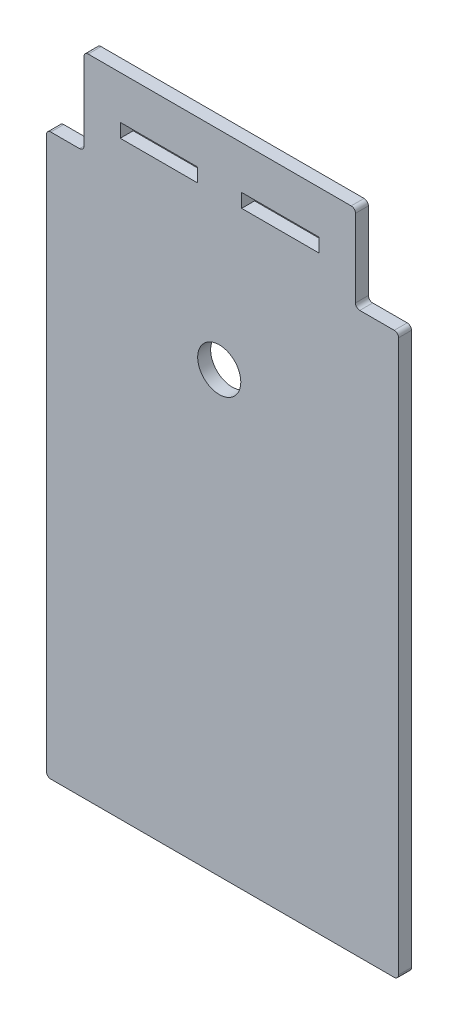
ISO-10303-21;
HEADER;
FILE_DESCRIPTION(('STEP AP214'),'2;1');
FILE_NAME('part.step','',(''),(''),'','','');
FILE_SCHEMA(('AUTOMOTIVE_DESIGN { 1 0 10303 214 1 1 1 1 }'));
ENDSEC;
DATA;
#1=APPLICATION_CONTEXT('core data for automotive mechanical design processes');
#2=APPLICATION_PROTOCOL_DEFINITION('international standard','automotive_design',2000,#1);
#3=PRODUCT_CONTEXT('',#1,'mechanical');
#4=PRODUCT('Part','Part','',(#3));
#5=PRODUCT_RELATED_PRODUCT_CATEGORY('part','',(#4));
#6=PRODUCT_DEFINITION_FORMATION('','',#4);
#7=PRODUCT_DEFINITION_CONTEXT('part definition',#1,'design');
#8=PRODUCT_DEFINITION('design','',#6,#7);
#9=PRODUCT_DEFINITION_SHAPE('','',#8);
#10=(LENGTH_UNIT() NAMED_UNIT(*) SI_UNIT(.MILLI.,.METRE.));
#11=(NAMED_UNIT(*) PLANE_ANGLE_UNIT() SI_UNIT($,.RADIAN.));
#12=(NAMED_UNIT(*) SI_UNIT($,.STERADIAN.) SOLID_ANGLE_UNIT());
#13=UNCERTAINTY_MEASURE_WITH_UNIT(LENGTH_MEASURE(1.E-05),#10,'distance_accuracy_value','');
#14=(GEOMETRIC_REPRESENTATION_CONTEXT(3) GLOBAL_UNCERTAINTY_ASSIGNED_CONTEXT((#13)) GLOBAL_UNIT_ASSIGNED_CONTEXT((#10,
#11,#12)) REPRESENTATION_CONTEXT('',''));
#15=CARTESIAN_POINT('',(0.,0.,0.));
#16=DIRECTION('',(0.,0.,1.));
#17=DIRECTION('',(1.,0.,0.));
#18=AXIS2_PLACEMENT_3D('',#15,#16,#17);
#19=CARTESIAN_POINT('',(65.1636113676577,34.,3.));
#20=DIRECTION('',(0.,0.,1.));
#21=DIRECTION('',(1.,0.,0.));
#22=AXIS2_PLACEMENT_3D('',#19,#20,#21);
#23=PLANE('',#22);
#24=CARTESIAN_POINT('',(65.1636113676577,34.,3.));
#25=DIRECTION('',(0.,0.,1.));
#26=DIRECTION('',(1.,0.,0.));
#27=AXIS2_PLACEMENT_3D('',#24,#25,#26);
#28=CIRCLE('',#27,1.);
#29=CARTESIAN_POINT('',(65.1636113676577,35.,3.));
#30=VERTEX_POINT('',#29);
#31=CARTESIAN_POINT('',(64.1636113676577,34.,3.));
#32=VERTEX_POINT('',#31);
#33=EDGE_CURVE('E267',#30,#32,#28,.T.);
#34=ORIENTED_EDGE('',*,*,#33,.T.);
#35=DIRECTION('',(0.,-1.,0.));
#36=VECTOR('',#35,1.);
#37=CARTESIAN_POINT('',(64.1636113676577,34.,3.));
#38=LINE('',#37,#36);
#39=CARTESIAN_POINT('',(64.1636113676577,-94.,3.));
#40=VERTEX_POINT('',#39);
#41=EDGE_CURVE('E270',#32,#40,#38,.T.);
#42=ORIENTED_EDGE('',*,*,#41,.T.);
#43=CARTESIAN_POINT('',(65.1636113676577,-94.,3.));
#44=DIRECTION('',(0.,0.,1.));
#45=DIRECTION('',(1.,0.,0.));
#46=AXIS2_PLACEMENT_3D('',#43,#44,#45);
#47=CIRCLE('',#46,1.);
#48=CARTESIAN_POINT('',(65.1636113676577,-95.,3.));
#49=VERTEX_POINT('',#48);
#50=EDGE_CURVE('E273',#40,#49,#47,.T.);
#51=ORIENTED_EDGE('',*,*,#50,.T.);
#52=DIRECTION('',(1.,0.,0.));
#53=VECTOR('',#52,1.);
#54=CARTESIAN_POINT('',(65.1636113676577,-95.,3.));
#55=LINE('',#54,#53);
#56=CARTESIAN_POINT('',(144.836388632342,-95.,3.));
#57=VERTEX_POINT('',#56);
#58=EDGE_CURVE('E275',#49,#57,#55,.T.);
#59=ORIENTED_EDGE('',*,*,#58,.T.);
#60=CARTESIAN_POINT('',(144.836388632342,-94.,3.));
#61=DIRECTION('',(0.,0.,1.));
#62=DIRECTION('',(1.,0.,0.));
#63=AXIS2_PLACEMENT_3D('',#60,#61,#62);
#64=CIRCLE('',#63,1.);
#65=CARTESIAN_POINT('',(145.836388632342,-94.,3.));
#66=VERTEX_POINT('',#65);
#67=EDGE_CURVE('E277',#57,#66,#64,.T.);
#68=ORIENTED_EDGE('',*,*,#67,.T.);
#69=DIRECTION('',(0.,1.,0.));
#70=VECTOR('',#69,1.);
#71=CARTESIAN_POINT('',(145.836388632342,-94.,3.));
#72=LINE('',#71,#70);
#73=CARTESIAN_POINT('',(145.836388632342,34.,3.));
#74=VERTEX_POINT('',#73);
#75=EDGE_CURVE('E279',#66,#74,#72,.T.);
#76=ORIENTED_EDGE('',*,*,#75,.T.);
#77=CARTESIAN_POINT('',(144.836388632342,34.,3.));
#78=DIRECTION('',(0.,0.,1.));
#79=DIRECTION('',(1.,0.,0.));
#80=AXIS2_PLACEMENT_3D('',#77,#78,#79);
#81=CIRCLE('',#80,1.);
#82=CARTESIAN_POINT('',(144.836388632342,35.,3.));
#83=VERTEX_POINT('',#82);
#84=EDGE_CURVE('E281',#74,#83,#81,.T.);
#85=ORIENTED_EDGE('',*,*,#84,.T.);
#86=DIRECTION('',(-1.,0.,0.));
#87=VECTOR('',#86,1.);
#88=CARTESIAN_POINT('',(144.836388632342,35.,3.));
#89=LINE('',#88,#87);
#90=CARTESIAN_POINT('',(136.836388632342,35.,3.));
#91=VERTEX_POINT('',#90);
#92=EDGE_CURVE('E283',#83,#91,#89,.T.);
#93=ORIENTED_EDGE('',*,*,#92,.T.);
#94=CARTESIAN_POINT('',(136.836388632342,36.,3.));
#95=DIRECTION('',(0.,0.,-1.));
#96=DIRECTION('',(1.,0.,0.));
#97=AXIS2_PLACEMENT_3D('',#94,#95,#96);
#98=CIRCLE('',#97,0.999999999999997);
#99=CARTESIAN_POINT('',(135.836388632342,36.,3.));
#100=VERTEX_POINT('',#99);
#101=EDGE_CURVE('E285',#91,#100,#98,.T.);
#102=ORIENTED_EDGE('',*,*,#101,.T.);
#103=DIRECTION('',(0.,1.,0.));
#104=VECTOR('',#103,1.);
#105=CARTESIAN_POINT('',(135.836388632342,36.,3.));
#106=LINE('',#105,#104);
#107=CARTESIAN_POINT('',(135.836388632342,54.,3.));
#108=VERTEX_POINT('',#107);
#109=EDGE_CURVE('E287',#100,#108,#106,.T.);
#110=ORIENTED_EDGE('',*,*,#109,.T.);
#111=CARTESIAN_POINT('',(134.836388632342,54.,3.));
#112=DIRECTION('',(0.,0.,1.));
#113=DIRECTION('',(1.,0.,0.));
#114=AXIS2_PLACEMENT_3D('',#111,#112,#113);
#115=CIRCLE('',#114,1.);
#116=CARTESIAN_POINT('',(134.836388632342,55.,3.));
#117=VERTEX_POINT('',#116);
#118=EDGE_CURVE('E289',#108,#117,#115,.T.);
#119=ORIENTED_EDGE('',*,*,#118,.T.);
#120=DIRECTION('',(-1.,0.,0.));
#121=VECTOR('',#120,1.);
#122=CARTESIAN_POINT('',(134.836388632342,55.,3.));
#123=LINE('',#122,#121);
#124=CARTESIAN_POINT('',(73.8363886323423,55.,3.));
#125=VERTEX_POINT('',#124);
#126=EDGE_CURVE('E291',#117,#125,#123,.T.);
#127=ORIENTED_EDGE('',*,*,#126,.T.);
#128=CARTESIAN_POINT('',(73.8363886323423,54.,3.));
#129=DIRECTION('',(0.,0.,1.));
#130=DIRECTION('',(1.,0.,0.));
#131=AXIS2_PLACEMENT_3D('',#128,#129,#130);
#132=CIRCLE('',#131,1.);
#133=CARTESIAN_POINT('',(72.8363886323423,54.,3.));
#134=VERTEX_POINT('',#133);
#135=EDGE_CURVE('E293',#125,#134,#132,.T.);
#136=ORIENTED_EDGE('',*,*,#135,.T.);
#137=DIRECTION('',(0.,-1.,0.));
#138=VECTOR('',#137,1.);
#139=CARTESIAN_POINT('',(72.8363886323423,54.,3.));
#140=LINE('',#139,#138);
#141=CARTESIAN_POINT('',(72.8363886323423,36.,3.));
#142=VERTEX_POINT('',#141);
#143=EDGE_CURVE('E295',#134,#142,#140,.T.);
#144=ORIENTED_EDGE('',*,*,#143,.T.);
#145=CARTESIAN_POINT('',(71.8363886323423,36.,3.));
#146=DIRECTION('',(0.,0.,-1.));
#147=DIRECTION('',(1.,0.,0.));
#148=AXIS2_PLACEMENT_3D('',#145,#146,#147);
#149=CIRCLE('',#148,0.999999999999997);
#150=CARTESIAN_POINT('',(71.8363886323423,35.,3.));
#151=VERTEX_POINT('',#150);
#152=EDGE_CURVE('E297',#142,#151,#149,.T.);
#153=ORIENTED_EDGE('',*,*,#152,.T.);
#154=DIRECTION('',(-1.,0.,0.));
#155=VECTOR('',#154,1.);
#156=CARTESIAN_POINT('',(71.8363886323423,35.,3.));
#157=LINE('',#156,#155);
#158=EDGE_CURVE('E299',#151,#30,#157,.T.);
#159=ORIENTED_EDGE('',*,*,#158,.T.);
#160=EDGE_LOOP('',(#34,#42,#51,#59,#68,#76,#85,#93,#102,#110,#119,#127,#136,#144,#153,#159));
#161=FACE_BOUND('',#160,.T.);
#162=CARTESIAN_POINT('',(104.236388632342,6.79999999999998,3.));
#163=DIRECTION('',(0.,0.,1.));
#164=DIRECTION('',(1.,0.,0.));
#165=AXIS2_PLACEMENT_3D('',#162,#163,#164);
#166=CIRCLE('',#165,5.);
#167=CARTESIAN_POINT('',(109.236388632342,6.79999999999998,3.));
#168=VERTEX_POINT('',#167);
#169=EDGE_CURVE('E261',#168,#168,#166,.T.);
#170=ORIENTED_EDGE('',*,*,#169,.F.);
#171=EDGE_LOOP('',(#170));
#172=FACE_BOUND('',#171,.T.);
#173=DIRECTION('',(-1.,0.,0.));
#174=VECTOR('',#173,1.);
#175=CARTESIAN_POINT('',(127.4,45.,3.));
#176=LINE('',#175,#174);
#177=CARTESIAN_POINT('',(127.4,45.,3.));
#178=VERTEX_POINT('',#177);
#179=CARTESIAN_POINT('',(109.436388632342,45.,3.));
#180=VERTEX_POINT('',#179);
#181=EDGE_CURVE('E232',#178,#180,#176,.T.);
#182=ORIENTED_EDGE('',*,*,#181,.F.);
#183=DIRECTION('',(0.,1.,0.));
#184=VECTOR('',#183,1.);
#185=CARTESIAN_POINT('',(127.4,41.8000000000001,3.));
#186=LINE('',#185,#184);
#187=CARTESIAN_POINT('',(127.4,41.8000000000001,3.));
#188=VERTEX_POINT('',#187);
#189=EDGE_CURVE('E230',#188,#178,#186,.T.);
#190=ORIENTED_EDGE('',*,*,#189,.F.);
#191=DIRECTION('',(1.,0.,0.));
#192=VECTOR('',#191,1.);
#193=CARTESIAN_POINT('',(109.436388632342,41.8000000000001,3.));
#194=LINE('',#193,#192);
#195=CARTESIAN_POINT('',(109.436388632342,41.8000000000001,3.));
#196=VERTEX_POINT('',#195);
#197=EDGE_CURVE('E238',#196,#188,#194,.T.);
#198=ORIENTED_EDGE('',*,*,#197,.F.);
#199=DIRECTION('',(0.,-1.,0.));
#200=VECTOR('',#199,1.);
#201=CARTESIAN_POINT('',(109.436388632342,45.,3.));
#202=LINE('',#201,#200);
#203=EDGE_CURVE('E235',#180,#196,#202,.T.);
#204=ORIENTED_EDGE('',*,*,#203,.F.);
#205=EDGE_LOOP('',(#182,#190,#198,#204));
#206=FACE_BOUND('',#205,.T.);
#207=DIRECTION('',(1.,0.,0.));
#208=VECTOR('',#207,1.);
#209=CARTESIAN_POINT('',(81.2727772646845,41.8000000000001,3.));
#210=LINE('',#209,#208);
#211=CARTESIAN_POINT('',(81.2727772646845,41.8000000000001,3.));
#212=VERTEX_POINT('',#211);
#213=CARTESIAN_POINT('',(99.2363886323423,41.8000000000001,3.));
#214=VERTEX_POINT('',#213);
#215=EDGE_CURVE('E202',#212,#214,#210,.T.);
#216=ORIENTED_EDGE('',*,*,#215,.F.);
#217=DIRECTION('',(0.,-1.,0.));
#218=VECTOR('',#217,1.);
#219=CARTESIAN_POINT('',(81.2727772646845,45.,3.));
#220=LINE('',#219,#218);
#221=CARTESIAN_POINT('',(81.2727772646845,45.,3.));
#222=VERTEX_POINT('',#221);
#223=EDGE_CURVE('E194',#222,#212,#220,.T.);
#224=ORIENTED_EDGE('',*,*,#223,.F.);
#225=DIRECTION('',(-1.,0.,0.));
#226=VECTOR('',#225,1.);
#227=CARTESIAN_POINT('',(99.2363886323423,45.,3.));
#228=LINE('',#227,#226);
#229=CARTESIAN_POINT('',(99.2363886323423,45.,3.));
#230=VERTEX_POINT('',#229);
#231=EDGE_CURVE('E216',#230,#222,#228,.T.);
#232=ORIENTED_EDGE('',*,*,#231,.F.);
#233=DIRECTION('',(0.,1.,0.));
#234=VECTOR('',#233,1.);
#235=CARTESIAN_POINT('',(99.2363886323423,41.8000000000001,3.));
#236=LINE('',#235,#234);
#237=EDGE_CURVE('E214',#214,#230,#236,.T.);
#238=ORIENTED_EDGE('',*,*,#237,.F.);
#239=EDGE_LOOP('',(#216,#224,#232,#238));
#240=FACE_BOUND('',#239,.T.);
#241=ADVANCED_FACE('F33',(#161,#172,#206,#240),#23,.T.);
#242=CARTESIAN_POINT('',(65.1636113676577,34.,0.));
#243=DIRECTION('',(0.,0.,1.));
#244=DIRECTION('',(1.,0.,0.));
#245=AXIS2_PLACEMENT_3D('',#242,#243,#244);
#246=PLANE('',#245);
#247=DIRECTION('',(0.,1.,0.));
#248=VECTOR('',#247,1.);
#249=CARTESIAN_POINT('',(127.4,41.8000000000001,0.));
#250=LINE('',#249,#248);
#251=CARTESIAN_POINT('',(127.4,41.8000000000001,0.));
#252=VERTEX_POINT('',#251);
#253=CARTESIAN_POINT('',(127.4,45.,0.));
#254=VERTEX_POINT('',#253);
#255=EDGE_CURVE('E210',#252,#254,#250,.T.);
#256=ORIENTED_EDGE('',*,*,#255,.T.);
#257=DIRECTION('',(-1.,0.,0.));
#258=VECTOR('',#257,1.);
#259=CARTESIAN_POINT('',(127.4,45.,0.));
#260=LINE('',#259,#258);
#261=CARTESIAN_POINT('',(109.436388632342,45.,0.));
#262=VERTEX_POINT('',#261);
#263=EDGE_CURVE('E243',#254,#262,#260,.T.);
#264=ORIENTED_EDGE('',*,*,#263,.T.);
#265=DIRECTION('',(0.,-1.,0.));
#266=VECTOR('',#265,1.);
#267=CARTESIAN_POINT('',(109.436388632342,45.,0.));
#268=LINE('',#267,#266);
#269=CARTESIAN_POINT('',(109.436388632342,41.8000000000001,0.));
#270=VERTEX_POINT('',#269);
#271=EDGE_CURVE('E246',#262,#270,#268,.T.);
#272=ORIENTED_EDGE('',*,*,#271,.T.);
#273=DIRECTION('',(1.,0.,0.));
#274=VECTOR('',#273,1.);
#275=CARTESIAN_POINT('',(109.436388632342,41.8000000000001,0.));
#276=LINE('',#275,#274);
#277=EDGE_CURVE('E233',#270,#252,#276,.T.);
#278=ORIENTED_EDGE('',*,*,#277,.T.);
#279=EDGE_LOOP('',(#256,#264,#272,#278));
#280=FACE_BOUND('',#279,.T.);
#281=CARTESIAN_POINT('',(65.1636113676577,34.,0.));
#282=DIRECTION('',(0.,0.,1.));
#283=DIRECTION('',(1.,0.,0.));
#284=AXIS2_PLACEMENT_3D('',#281,#282,#283);
#285=CIRCLE('',#284,1.);
#286=CARTESIAN_POINT('',(65.1636113676577,35.,0.));
#287=VERTEX_POINT('',#286);
#288=CARTESIAN_POINT('',(64.1636113676577,34.,0.));
#289=VERTEX_POINT('',#288);
#290=EDGE_CURVE('E264',#287,#289,#285,.T.);
#291=ORIENTED_EDGE('',*,*,#290,.F.);
#292=DIRECTION('',(-1.,0.,0.));
#293=VECTOR('',#292,1.);
#294=CARTESIAN_POINT('',(71.8363886323423,35.,0.));
#295=LINE('',#294,#293);
#296=CARTESIAN_POINT('',(71.8363886323423,35.,0.));
#297=VERTEX_POINT('',#296);
#298=EDGE_CURVE('E271',#297,#287,#295,.T.);
#299=ORIENTED_EDGE('',*,*,#298,.F.);
#300=CARTESIAN_POINT('',(71.8363886323423,36.,0.));
#301=DIRECTION('',(0.,0.,-1.));
#302=DIRECTION('',(1.,0.,0.));
#303=AXIS2_PLACEMENT_3D('',#300,#301,#302);
#304=CIRCLE('',#303,0.999999999999997);
#305=CARTESIAN_POINT('',(72.8363886323423,36.,0.));
#306=VERTEX_POINT('',#305);
#307=EDGE_CURVE('E330',#306,#297,#304,.T.);
#308=ORIENTED_EDGE('',*,*,#307,.F.);
#309=DIRECTION('',(0.,-1.,0.));
#310=VECTOR('',#309,1.);
#311=CARTESIAN_POINT('',(72.8363886323423,54.,0.));
#312=LINE('',#311,#310);
#313=CARTESIAN_POINT('',(72.8363886323423,54.,0.));
#314=VERTEX_POINT('',#313);
#315=EDGE_CURVE('E328',#314,#306,#312,.T.);
#316=ORIENTED_EDGE('',*,*,#315,.F.);
#317=CARTESIAN_POINT('',(73.8363886323423,54.,0.));
#318=DIRECTION('',(0.,0.,1.));
#319=DIRECTION('',(1.,0.,0.));
#320=AXIS2_PLACEMENT_3D('',#317,#318,#319);
#321=CIRCLE('',#320,1.);
#322=CARTESIAN_POINT('',(73.8363886323423,55.,0.));
#323=VERTEX_POINT('',#322);
#324=EDGE_CURVE('E326',#323,#314,#321,.T.);
#325=ORIENTED_EDGE('',*,*,#324,.F.);
#326=DIRECTION('',(-1.,0.,0.));
#327=VECTOR('',#326,1.);
#328=CARTESIAN_POINT('',(134.836388632342,55.,0.));
#329=LINE('',#328,#327);
#330=CARTESIAN_POINT('',(134.836388632342,55.,0.));
#331=VERTEX_POINT('',#330);
#332=EDGE_CURVE('E324',#331,#323,#329,.T.);
#333=ORIENTED_EDGE('',*,*,#332,.F.);
#334=CARTESIAN_POINT('',(134.836388632342,54.,0.));
#335=DIRECTION('',(0.,0.,1.));
#336=DIRECTION('',(1.,0.,0.));
#337=AXIS2_PLACEMENT_3D('',#334,#335,#336);
#338=CIRCLE('',#337,1.);
#339=CARTESIAN_POINT('',(135.836388632342,54.,0.));
#340=VERTEX_POINT('',#339);
#341=EDGE_CURVE('E322',#340,#331,#338,.T.);
#342=ORIENTED_EDGE('',*,*,#341,.F.);
#343=DIRECTION('',(0.,1.,0.));
#344=VECTOR('',#343,1.);
#345=CARTESIAN_POINT('',(135.836388632342,36.,0.));
#346=LINE('',#345,#344);
#347=CARTESIAN_POINT('',(135.836388632342,36.,0.));
#348=VERTEX_POINT('',#347);
#349=EDGE_CURVE('E320',#348,#340,#346,.T.);
#350=ORIENTED_EDGE('',*,*,#349,.F.);
#351=CARTESIAN_POINT('',(136.836388632342,36.,0.));
#352=DIRECTION('',(0.,0.,-1.));
#353=DIRECTION('',(1.,0.,0.));
#354=AXIS2_PLACEMENT_3D('',#351,#352,#353);
#355=CIRCLE('',#354,0.999999999999997);
#356=CARTESIAN_POINT('',(136.836388632342,35.,0.));
#357=VERTEX_POINT('',#356);
#358=EDGE_CURVE('E318',#357,#348,#355,.T.);
#359=ORIENTED_EDGE('',*,*,#358,.F.);
#360=DIRECTION('',(-1.,0.,0.));
#361=VECTOR('',#360,1.);
#362=CARTESIAN_POINT('',(144.836388632342,35.,0.));
#363=LINE('',#362,#361);
#364=CARTESIAN_POINT('',(144.836388632342,35.,0.));
#365=VERTEX_POINT('',#364);
#366=EDGE_CURVE('E316',#365,#357,#363,.T.);
#367=ORIENTED_EDGE('',*,*,#366,.F.);
#368=CARTESIAN_POINT('',(144.836388632342,34.,0.));
#369=DIRECTION('',(0.,0.,1.));
#370=DIRECTION('',(1.,0.,0.));
#371=AXIS2_PLACEMENT_3D('',#368,#369,#370);
#372=CIRCLE('',#371,1.);
#373=CARTESIAN_POINT('',(145.836388632342,34.,0.));
#374=VERTEX_POINT('',#373);
#375=EDGE_CURVE('E314',#374,#365,#372,.T.);
#376=ORIENTED_EDGE('',*,*,#375,.F.);
#377=DIRECTION('',(0.,1.,0.));
#378=VECTOR('',#377,1.);
#379=CARTESIAN_POINT('',(145.836388632342,-94.,0.));
#380=LINE('',#379,#378);
#381=CARTESIAN_POINT('',(145.836388632342,-94.,0.));
#382=VERTEX_POINT('',#381);
#383=EDGE_CURVE('E312',#382,#374,#380,.T.);
#384=ORIENTED_EDGE('',*,*,#383,.F.);
#385=CARTESIAN_POINT('',(144.836388632342,-94.,0.));
#386=DIRECTION('',(0.,0.,1.));
#387=DIRECTION('',(1.,0.,0.));
#388=AXIS2_PLACEMENT_3D('',#385,#386,#387);
#389=CIRCLE('',#388,1.);
#390=CARTESIAN_POINT('',(144.836388632342,-95.,0.));
#391=VERTEX_POINT('',#390);
#392=EDGE_CURVE('E310',#391,#382,#389,.T.);
#393=ORIENTED_EDGE('',*,*,#392,.F.);
#394=DIRECTION('',(1.,0.,0.));
#395=VECTOR('',#394,1.);
#396=CARTESIAN_POINT('',(65.1636113676577,-95.,0.));
#397=LINE('',#396,#395);
#398=CARTESIAN_POINT('',(65.1636113676577,-95.,0.));
#399=VERTEX_POINT('',#398);
#400=EDGE_CURVE('E308',#399,#391,#397,.T.);
#401=ORIENTED_EDGE('',*,*,#400,.F.);
#402=CARTESIAN_POINT('',(65.1636113676577,-94.,0.));
#403=DIRECTION('',(0.,0.,1.));
#404=DIRECTION('',(1.,0.,0.));
#405=AXIS2_PLACEMENT_3D('',#402,#403,#404);
#406=CIRCLE('',#405,1.);
#407=CARTESIAN_POINT('',(64.1636113676577,-94.,0.));
#408=VERTEX_POINT('',#407);
#409=EDGE_CURVE('E306',#408,#399,#406,.T.);
#410=ORIENTED_EDGE('',*,*,#409,.F.);
#411=DIRECTION('',(0.,-1.,0.));
#412=VECTOR('',#411,1.);
#413=CARTESIAN_POINT('',(64.1636113676577,-39.6153776325345,0.));
#414=LINE('',#413,#412);
#415=EDGE_CURVE('E304',#289,#408,#414,.T.);
#416=ORIENTED_EDGE('',*,*,#415,.F.);
#417=EDGE_LOOP('',(#291,#299,#308,#316,#325,#333,#342,#350,#359,#367,#376,#384,#393,#401,#410,#416));
#418=FACE_BOUND('',#417,.T.);
#419=CARTESIAN_POINT('',(104.236388632342,6.79999999999998,0.));
#420=DIRECTION('',(0.,0.,1.));
#421=DIRECTION('',(1.,0.,0.));
#422=AXIS2_PLACEMENT_3D('',#419,#420,#421);
#423=CIRCLE('',#422,5.);
#424=CARTESIAN_POINT('',(109.236388632342,6.79999999999998,0.));
#425=VERTEX_POINT('',#424);
#426=EDGE_CURVE('E260',#425,#425,#423,.T.);
#427=ORIENTED_EDGE('',*,*,#426,.T.);
#428=EDGE_LOOP('',(#427));
#429=FACE_BOUND('',#428,.T.);
#430=DIRECTION('',(0.,-1.,0.));
#431=VECTOR('',#430,1.);
#432=CARTESIAN_POINT('',(81.2727772646845,45.,0.));
#433=LINE('',#432,#431);
#434=CARTESIAN_POINT('',(81.2727772646845,45.,0.));
#435=VERTEX_POINT('',#434);
#436=CARTESIAN_POINT('',(81.2727772646845,41.8000000000001,0.));
#437=VERTEX_POINT('',#436);
#438=EDGE_CURVE('E56',#435,#437,#433,.T.);
#439=ORIENTED_EDGE('',*,*,#438,.T.);
#440=DIRECTION('',(1.,0.,0.));
#441=VECTOR('',#440,1.);
#442=CARTESIAN_POINT('',(81.2727772646845,41.8000000000001,0.));
#443=LINE('',#442,#441);
#444=CARTESIAN_POINT('',(99.2363886323423,41.8000000000001,0.));
#445=VERTEX_POINT('',#444);
#446=EDGE_CURVE('E209',#437,#445,#443,.T.);
#447=ORIENTED_EDGE('',*,*,#446,.T.);
#448=DIRECTION('',(0.,1.,0.));
#449=VECTOR('',#448,1.);
#450=CARTESIAN_POINT('',(99.2363886323423,41.8000000000001,0.));
#451=LINE('',#450,#449);
#452=CARTESIAN_POINT('',(99.2363886323423,45.,0.));
#453=VERTEX_POINT('',#452);
#454=EDGE_CURVE('E222',#445,#453,#451,.T.);
#455=ORIENTED_EDGE('',*,*,#454,.T.);
#456=DIRECTION('',(-1.,0.,0.));
#457=VECTOR('',#456,1.);
#458=CARTESIAN_POINT('',(99.2363886323423,45.,0.));
#459=LINE('',#458,#457);
#460=EDGE_CURVE('E203',#453,#435,#459,.T.);
#461=ORIENTED_EDGE('',*,*,#460,.T.);
#462=EDGE_LOOP('',(#439,#447,#455,#461));
#463=FACE_BOUND('',#462,.T.);
#464=ADVANCED_FACE('F384',(#280,#418,#429,#463),#246,.F.);
#465=CARTESIAN_POINT('',(65.1636113676577,34.,3.));
#466=DIRECTION('',(0.,0.,-1.));
#467=DIRECTION('',(-1.,0.,0.));
#468=AXIS2_PLACEMENT_3D('',#465,#466,#467);
#469=CYLINDRICAL_SURFACE('',#468,1.);
#470=ORIENTED_EDGE('',*,*,#290,.T.);
#471=DIRECTION('',(0.,0.,-1.));
#472=VECTOR('',#471,1.);
#473=CARTESIAN_POINT('',(64.1636113676577,34.,3.));
#474=LINE('',#473,#472);
#475=EDGE_CURVE('E11',#32,#289,#474,.T.);
#476=ORIENTED_EDGE('',*,*,#475,.F.);
#477=ORIENTED_EDGE('',*,*,#33,.F.);
#478=DIRECTION('',(0.,0.,-1.));
#479=VECTOR('',#478,1.);
#480=CARTESIAN_POINT('',(65.1636113676577,35.,3.));
#481=LINE('',#480,#479);
#482=EDGE_CURVE('E301',#30,#287,#481,.T.);
#483=ORIENTED_EDGE('',*,*,#482,.T.);
#484=EDGE_LOOP('',(#470,#476,#477,#483));
#485=FACE_BOUND('',#484,.T.);
#486=ADVANCED_FACE('F35',(#485),#469,.T.);
#487=CARTESIAN_POINT('',(64.1636113676577,-39.6153776325345,3.));
#488=DIRECTION('',(1.,0.,0.));
#489=DIRECTION('',(0.,0.,-1.));
#490=AXIS2_PLACEMENT_3D('',#487,#488,#489);
#491=PLANE('',#490);
#492=ORIENTED_EDGE('',*,*,#415,.T.);
#493=DIRECTION('',(0.,0.,-1.));
#494=VECTOR('',#493,1.);
#495=CARTESIAN_POINT('',(64.1636113676577,-94.,3.));
#496=LINE('',#495,#494);
#497=EDGE_CURVE('E41',#40,#408,#496,.T.);
#498=ORIENTED_EDGE('',*,*,#497,.F.);
#499=ORIENTED_EDGE('',*,*,#41,.F.);
#500=ORIENTED_EDGE('',*,*,#475,.T.);
#501=EDGE_LOOP('',(#492,#498,#499,#500));
#502=FACE_BOUND('',#501,.T.);
#503=ADVANCED_FACE('F402',(#502),#491,.F.);
#504=CARTESIAN_POINT('',(65.1636113676577,-94.,3.));
#505=DIRECTION('',(0.,0.,-1.));
#506=DIRECTION('',(-1.,0.,0.));
#507=AXIS2_PLACEMENT_3D('',#504,#505,#506);
#508=CYLINDRICAL_SURFACE('',#507,1.);
#509=ORIENTED_EDGE('',*,*,#409,.T.);
#510=DIRECTION('',(0.,0.,-1.));
#511=VECTOR('',#510,1.);
#512=CARTESIAN_POINT('',(65.1636113676577,-95.,3.));
#513=LINE('',#512,#511);
#514=EDGE_CURVE('E371',#49,#399,#513,.T.);
#515=ORIENTED_EDGE('',*,*,#514,.F.);
#516=ORIENTED_EDGE('',*,*,#50,.F.);
#517=ORIENTED_EDGE('',*,*,#497,.T.);
#518=EDGE_LOOP('',(#509,#515,#516,#517));
#519=FACE_BOUND('',#518,.T.);
#520=ADVANCED_FACE('F378',(#519),#508,.T.);
#521=CARTESIAN_POINT('',(65.1636113676577,-95.,3.));
#522=DIRECTION('',(0.,1.,0.));
#523=DIRECTION('',(0.,0.,1.));
#524=AXIS2_PLACEMENT_3D('',#521,#522,#523);
#525=PLANE('',#524);
#526=ORIENTED_EDGE('',*,*,#400,.T.);
#527=DIRECTION('',(0.,0.,-1.));
#528=VECTOR('',#527,1.);
#529=CARTESIAN_POINT('',(144.836388632342,-95.,3.));
#530=LINE('',#529,#528);
#531=EDGE_CURVE('E368',#57,#391,#530,.T.);
#532=ORIENTED_EDGE('',*,*,#531,.F.);
#533=ORIENTED_EDGE('',*,*,#58,.F.);
#534=ORIENTED_EDGE('',*,*,#514,.T.);
#535=EDGE_LOOP('',(#526,#532,#533,#534));
#536=FACE_BOUND('',#535,.T.);
#537=ADVANCED_FACE('F390',(#536),#525,.F.);
#538=CARTESIAN_POINT('',(144.836388632342,-94.,3.));
#539=DIRECTION('',(0.,0.,-1.));
#540=DIRECTION('',(-1.,0.,0.));
#541=AXIS2_PLACEMENT_3D('',#538,#539,#540);
#542=CYLINDRICAL_SURFACE('',#541,1.);
#543=ORIENTED_EDGE('',*,*,#392,.T.);
#544=DIRECTION('',(0.,0.,-1.));
#545=VECTOR('',#544,1.);
#546=CARTESIAN_POINT('',(145.836388632342,-94.,3.));
#547=LINE('',#546,#545);
#548=EDGE_CURVE('E365',#66,#382,#547,.T.);
#549=ORIENTED_EDGE('',*,*,#548,.F.);
#550=ORIENTED_EDGE('',*,*,#67,.F.);
#551=ORIENTED_EDGE('',*,*,#531,.T.);
#552=EDGE_LOOP('',(#543,#549,#550,#551));
#553=FACE_BOUND('',#552,.T.);
#554=ADVANCED_FACE('F394',(#553),#542,.T.);
#555=CARTESIAN_POINT('',(145.836388632342,-94.,3.));
#556=DIRECTION('',(-1.,0.,0.));
#557=DIRECTION('',(0.,0.,1.));
#558=AXIS2_PLACEMENT_3D('',#555,#556,#557);
#559=PLANE('',#558);
#560=ORIENTED_EDGE('',*,*,#383,.T.);
#561=DIRECTION('',(0.,0.,-1.));
#562=VECTOR('',#561,1.);
#563=CARTESIAN_POINT('',(145.836388632342,34.,3.));
#564=LINE('',#563,#562);
#565=EDGE_CURVE('E362',#74,#374,#564,.T.);
#566=ORIENTED_EDGE('',*,*,#565,.F.);
#567=ORIENTED_EDGE('',*,*,#75,.F.);
#568=ORIENTED_EDGE('',*,*,#548,.T.);
#569=EDGE_LOOP('',(#560,#566,#567,#568));
#570=FACE_BOUND('',#569,.T.);
#571=ADVANCED_FACE('F455',(#570),#559,.F.);
#572=CARTESIAN_POINT('',(144.836388632342,34.,3.));
#573=DIRECTION('',(0.,0.,-1.));
#574=DIRECTION('',(-1.,0.,0.));
#575=AXIS2_PLACEMENT_3D('',#572,#573,#574);
#576=CYLINDRICAL_SURFACE('',#575,1.);
#577=ORIENTED_EDGE('',*,*,#375,.T.);
#578=DIRECTION('',(0.,0.,-1.));
#579=VECTOR('',#578,1.);
#580=CARTESIAN_POINT('',(144.836388632342,35.,3.));
#581=LINE('',#580,#579);
#582=EDGE_CURVE('E359',#83,#365,#581,.T.);
#583=ORIENTED_EDGE('',*,*,#582,.F.);
#584=ORIENTED_EDGE('',*,*,#84,.F.);
#585=ORIENTED_EDGE('',*,*,#565,.T.);
#586=EDGE_LOOP('',(#577,#583,#584,#585));
#587=FACE_BOUND('',#586,.T.);
#588=ADVANCED_FACE('F452',(#587),#576,.T.);
#589=CARTESIAN_POINT('',(144.836388632342,35.,3.));
#590=DIRECTION('',(0.,-1.,0.));
#591=DIRECTION('',(0.,0.,-1.));
#592=AXIS2_PLACEMENT_3D('',#589,#590,#591);
#593=PLANE('',#592);
#594=ORIENTED_EDGE('',*,*,#366,.T.);
#595=DIRECTION('',(0.,0.,-1.));
#596=VECTOR('',#595,1.);
#597=CARTESIAN_POINT('',(136.836388632342,35.,3.));
#598=LINE('',#597,#596);
#599=EDGE_CURVE('E356',#91,#357,#598,.T.);
#600=ORIENTED_EDGE('',*,*,#599,.F.);
#601=ORIENTED_EDGE('',*,*,#92,.F.);
#602=ORIENTED_EDGE('',*,*,#582,.T.);
#603=EDGE_LOOP('',(#594,#600,#601,#602));
#604=FACE_BOUND('',#603,.T.);
#605=ADVANCED_FACE('F448',(#604),#593,.F.);
#606=CARTESIAN_POINT('',(136.836388632342,36.,3.));
#607=DIRECTION('',(0.,0.,-1.));
#608=DIRECTION('',(-1.,0.,0.));
#609=AXIS2_PLACEMENT_3D('',#606,#607,#608);
#610=CYLINDRICAL_SURFACE('',#609,0.999999999999997);
#611=ORIENTED_EDGE('',*,*,#358,.T.);
#612=DIRECTION('',(0.,0.,-1.));
#613=VECTOR('',#612,1.);
#614=CARTESIAN_POINT('',(135.836388632342,36.,3.));
#615=LINE('',#614,#613);
#616=EDGE_CURVE('E353',#100,#348,#615,.T.);
#617=ORIENTED_EDGE('',*,*,#616,.F.);
#618=ORIENTED_EDGE('',*,*,#101,.F.);
#619=ORIENTED_EDGE('',*,*,#599,.T.);
#620=EDGE_LOOP('',(#611,#617,#618,#619));
#621=FACE_BOUND('',#620,.T.);
#622=ADVANCED_FACE('F444',(#621),#610,.F.);
#623=CARTESIAN_POINT('',(135.836388632342,36.,3.));
#624=DIRECTION('',(-1.,0.,0.));
#625=DIRECTION('',(0.,0.,1.));
#626=AXIS2_PLACEMENT_3D('',#623,#624,#625);
#627=PLANE('',#626);
#628=ORIENTED_EDGE('',*,*,#349,.T.);
#629=DIRECTION('',(0.,0.,-1.));
#630=VECTOR('',#629,1.);
#631=CARTESIAN_POINT('',(135.836388632342,54.,3.));
#632=LINE('',#631,#630);
#633=EDGE_CURVE('E350',#108,#340,#632,.T.);
#634=ORIENTED_EDGE('',*,*,#633,.F.);
#635=ORIENTED_EDGE('',*,*,#109,.F.);
#636=ORIENTED_EDGE('',*,*,#616,.T.);
#637=EDGE_LOOP('',(#628,#634,#635,#636));
#638=FACE_BOUND('',#637,.T.);
#639=ADVANCED_FACE('F439',(#638),#627,.F.);
#640=CARTESIAN_POINT('',(134.836388632342,54.,3.));
#641=DIRECTION('',(0.,0.,-1.));
#642=DIRECTION('',(-1.,0.,0.));
#643=AXIS2_PLACEMENT_3D('',#640,#641,#642);
#644=CYLINDRICAL_SURFACE('',#643,1.);
#645=ORIENTED_EDGE('',*,*,#341,.T.);
#646=DIRECTION('',(0.,0.,-1.));
#647=VECTOR('',#646,1.);
#648=CARTESIAN_POINT('',(134.836388632342,55.,3.));
#649=LINE('',#648,#647);
#650=EDGE_CURVE('E347',#117,#331,#649,.T.);
#651=ORIENTED_EDGE('',*,*,#650,.F.);
#652=ORIENTED_EDGE('',*,*,#118,.F.);
#653=ORIENTED_EDGE('',*,*,#633,.T.);
#654=EDGE_LOOP('',(#645,#651,#652,#653));
#655=FACE_BOUND('',#654,.T.);
#656=ADVANCED_FACE('F433',(#655),#644,.T.);
#657=CARTESIAN_POINT('',(134.836388632342,55.,3.));
#658=DIRECTION('',(0.,-1.,0.));
#659=DIRECTION('',(0.,0.,-1.));
#660=AXIS2_PLACEMENT_3D('',#657,#658,#659);
#661=PLANE('',#660);
#662=ORIENTED_EDGE('',*,*,#332,.T.);
#663=DIRECTION('',(0.,0.,-1.));
#664=VECTOR('',#663,1.);
#665=CARTESIAN_POINT('',(73.8363886323423,55.,3.));
#666=LINE('',#665,#664);
#667=EDGE_CURVE('E344',#125,#323,#666,.T.);
#668=ORIENTED_EDGE('',*,*,#667,.F.);
#669=ORIENTED_EDGE('',*,*,#126,.F.);
#670=ORIENTED_EDGE('',*,*,#650,.T.);
#671=EDGE_LOOP('',(#662,#668,#669,#670));
#672=FACE_BOUND('',#671,.T.);
#673=ADVANCED_FACE('F429',(#672),#661,.F.);
#674=CARTESIAN_POINT('',(73.8363886323423,54.,3.));
#675=DIRECTION('',(0.,0.,-1.));
#676=DIRECTION('',(-1.,0.,0.));
#677=AXIS2_PLACEMENT_3D('',#674,#675,#676);
#678=CYLINDRICAL_SURFACE('',#677,1.);
#679=ORIENTED_EDGE('',*,*,#324,.T.);
#680=DIRECTION('',(0.,0.,-1.));
#681=VECTOR('',#680,1.);
#682=CARTESIAN_POINT('',(72.8363886323423,54.,3.));
#683=LINE('',#682,#681);
#684=EDGE_CURVE('E341',#134,#314,#683,.T.);
#685=ORIENTED_EDGE('',*,*,#684,.F.);
#686=ORIENTED_EDGE('',*,*,#135,.F.);
#687=ORIENTED_EDGE('',*,*,#667,.T.);
#688=EDGE_LOOP('',(#679,#685,#686,#687));
#689=FACE_BOUND('',#688,.T.);
#690=ADVANCED_FACE('F424',(#689),#678,.T.);
#691=CARTESIAN_POINT('',(72.8363886323423,54.,3.));
#692=DIRECTION('',(1.,0.,0.));
#693=DIRECTION('',(0.,0.,-1.));
#694=AXIS2_PLACEMENT_3D('',#691,#692,#693);
#695=PLANE('',#694);
#696=ORIENTED_EDGE('',*,*,#315,.T.);
#697=DIRECTION('',(0.,0.,-1.));
#698=VECTOR('',#697,1.);
#699=CARTESIAN_POINT('',(72.8363886323423,36.,3.));
#700=LINE('',#699,#698);
#701=EDGE_CURVE('E338',#142,#306,#700,.T.);
#702=ORIENTED_EDGE('',*,*,#701,.F.);
#703=ORIENTED_EDGE('',*,*,#143,.F.);
#704=ORIENTED_EDGE('',*,*,#684,.T.);
#705=EDGE_LOOP('',(#696,#702,#703,#704));
#706=FACE_BOUND('',#705,.T.);
#707=ADVANCED_FACE('F418',(#706),#695,.F.);
#708=CARTESIAN_POINT('',(71.8363886323423,36.,3.));
#709=DIRECTION('',(0.,0.,-1.));
#710=DIRECTION('',(-1.,0.,0.));
#711=AXIS2_PLACEMENT_3D('',#708,#709,#710);
#712=CYLINDRICAL_SURFACE('',#711,0.999999999999997);
#713=ORIENTED_EDGE('',*,*,#307,.T.);
#714=DIRECTION('',(0.,0.,-1.));
#715=VECTOR('',#714,1.);
#716=CARTESIAN_POINT('',(71.8363886323423,35.,3.));
#717=LINE('',#716,#715);
#718=EDGE_CURVE('E335',#151,#297,#717,.T.);
#719=ORIENTED_EDGE('',*,*,#718,.F.);
#720=ORIENTED_EDGE('',*,*,#152,.F.);
#721=ORIENTED_EDGE('',*,*,#701,.T.);
#722=EDGE_LOOP('',(#713,#719,#720,#721));
#723=FACE_BOUND('',#722,.T.);
#724=ADVANCED_FACE('F414',(#723),#712,.F.);
#725=CARTESIAN_POINT('',(71.8363886323423,35.,3.));
#726=DIRECTION('',(0.,-1.,0.));
#727=DIRECTION('',(0.,0.,-1.));
#728=AXIS2_PLACEMENT_3D('',#725,#726,#727);
#729=PLANE('',#728);
#730=ORIENTED_EDGE('',*,*,#298,.T.);
#731=ORIENTED_EDGE('',*,*,#482,.F.);
#732=ORIENTED_EDGE('',*,*,#158,.F.);
#733=ORIENTED_EDGE('',*,*,#718,.T.);
#734=EDGE_LOOP('',(#730,#731,#732,#733));
#735=FACE_BOUND('',#734,.T.);
#736=ADVANCED_FACE('F409',(#735),#729,.F.);
#737=CARTESIAN_POINT('',(104.236388632342,6.79999999999998,3.));
#738=DIRECTION('',(0.,0.,-1.));
#739=DIRECTION('',(-1.,0.,0.));
#740=AXIS2_PLACEMENT_3D('',#737,#738,#739);
#741=CYLINDRICAL_SURFACE('',#740,5.);
#742=ORIENTED_EDGE('',*,*,#169,.T.);
#743=EDGE_LOOP('',(#742));
#744=FACE_BOUND('',#743,.T.);
#745=ORIENTED_EDGE('',*,*,#426,.F.);
#746=EDGE_LOOP('',(#745));
#747=FACE_BOUND('',#746,.T.);
#748=ADVANCED_FACE('F472',(#744,#747),#741,.F.);
#749=CARTESIAN_POINT('',(127.4,41.8000000000001,3.));
#750=DIRECTION('',(-1.,0.,0.));
#751=DIRECTION('',(0.,0.,1.));
#752=AXIS2_PLACEMENT_3D('',#749,#750,#751);
#753=PLANE('',#752);
#754=ORIENTED_EDGE('',*,*,#255,.F.);
#755=DIRECTION('',(0.,0.,-1.));
#756=VECTOR('',#755,1.);
#757=CARTESIAN_POINT('',(127.4,41.8000000000001,3.));
#758=LINE('',#757,#756);
#759=EDGE_CURVE('E240',#188,#252,#758,.T.);
#760=ORIENTED_EDGE('',*,*,#759,.F.);
#761=ORIENTED_EDGE('',*,*,#189,.T.);
#762=DIRECTION('',(0.,0.,-1.));
#763=VECTOR('',#762,1.);
#764=CARTESIAN_POINT('',(127.4,45.,3.));
#765=LINE('',#764,#763);
#766=EDGE_CURVE('E257',#178,#254,#765,.T.);
#767=ORIENTED_EDGE('',*,*,#766,.T.);
#768=EDGE_LOOP('',(#754,#760,#761,#767));
#769=FACE_BOUND('',#768,.T.);
#770=ADVANCED_FACE('F534',(#769),#753,.T.);
#771=CARTESIAN_POINT('',(127.4,45.,3.));
#772=DIRECTION('',(0.,-1.,0.));
#773=DIRECTION('',(0.,0.,-1.));
#774=AXIS2_PLACEMENT_3D('',#771,#772,#773);
#775=PLANE('',#774);
#776=ORIENTED_EDGE('',*,*,#263,.F.);
#777=ORIENTED_EDGE('',*,*,#766,.F.);
#778=ORIENTED_EDGE('',*,*,#181,.T.);
#779=DIRECTION('',(0.,0.,-1.));
#780=VECTOR('',#779,1.);
#781=CARTESIAN_POINT('',(109.436388632342,45.,3.));
#782=LINE('',#781,#780);
#783=EDGE_CURVE('E255',#180,#262,#782,.T.);
#784=ORIENTED_EDGE('',*,*,#783,.T.);
#785=EDGE_LOOP('',(#776,#777,#778,#784));
#786=FACE_BOUND('',#785,.T.);
#787=ADVANCED_FACE('F541',(#786),#775,.T.);
#788=CARTESIAN_POINT('',(109.436388632342,45.,3.));
#789=DIRECTION('',(1.,0.,0.));
#790=DIRECTION('',(0.,0.,-1.));
#791=AXIS2_PLACEMENT_3D('',#788,#789,#790);
#792=PLANE('',#791);
#793=ORIENTED_EDGE('',*,*,#271,.F.);
#794=ORIENTED_EDGE('',*,*,#783,.F.);
#795=ORIENTED_EDGE('',*,*,#203,.T.);
#796=DIRECTION('',(0.,0.,-1.));
#797=VECTOR('',#796,1.);
#798=CARTESIAN_POINT('',(109.436388632342,41.8000000000001,3.));
#799=LINE('',#798,#797);
#800=EDGE_CURVE('E253',#196,#270,#799,.T.);
#801=ORIENTED_EDGE('',*,*,#800,.T.);
#802=EDGE_LOOP('',(#793,#794,#795,#801));
#803=FACE_BOUND('',#802,.T.);
#804=ADVANCED_FACE('F548',(#803),#792,.T.);
#805=CARTESIAN_POINT('',(109.436388632342,41.8000000000001,3.));
#806=DIRECTION('',(0.,1.,0.));
#807=DIRECTION('',(0.,0.,1.));
#808=AXIS2_PLACEMENT_3D('',#805,#806,#807);
#809=PLANE('',#808);
#810=ORIENTED_EDGE('',*,*,#277,.F.);
#811=ORIENTED_EDGE('',*,*,#800,.F.);
#812=ORIENTED_EDGE('',*,*,#197,.T.);
#813=ORIENTED_EDGE('',*,*,#759,.T.);
#814=EDGE_LOOP('',(#810,#811,#812,#813));
#815=FACE_BOUND('',#814,.T.);
#816=ADVANCED_FACE('F556',(#815),#809,.T.);
#817=CARTESIAN_POINT('',(81.2727772646845,45.,3.));
#818=DIRECTION('',(1.,0.,0.));
#819=DIRECTION('',(0.,0.,-1.));
#820=AXIS2_PLACEMENT_3D('',#817,#818,#819);
#821=PLANE('',#820);
#822=ORIENTED_EDGE('',*,*,#438,.F.);
#823=DIRECTION('',(0.,0.,-1.));
#824=VECTOR('',#823,1.);
#825=CARTESIAN_POINT('',(81.2727772646845,45.,3.));
#826=LINE('',#825,#824);
#827=EDGE_CURVE('E198',#222,#435,#826,.T.);
#828=ORIENTED_EDGE('',*,*,#827,.F.);
#829=ORIENTED_EDGE('',*,*,#223,.T.);
#830=DIRECTION('',(0.,0.,-1.));
#831=VECTOR('',#830,1.);
#832=CARTESIAN_POINT('',(81.2727772646845,41.8000000000001,3.));
#833=LINE('',#832,#831);
#834=EDGE_CURVE('E197',#212,#437,#833,.T.);
#835=ORIENTED_EDGE('',*,*,#834,.T.);
#836=EDGE_LOOP('',(#822,#828,#829,#835));
#837=FACE_BOUND('',#836,.T.);
#838=ADVANCED_FACE('F196',(#837),#821,.T.);
#839=CARTESIAN_POINT('',(81.2727772646845,41.8000000000001,3.));
#840=DIRECTION('',(0.,1.,0.));
#841=DIRECTION('',(0.,0.,1.));
#842=AXIS2_PLACEMENT_3D('',#839,#840,#841);
#843=PLANE('',#842);
#844=ORIENTED_EDGE('',*,*,#446,.F.);
#845=ORIENTED_EDGE('',*,*,#834,.F.);
#846=ORIENTED_EDGE('',*,*,#215,.T.);
#847=DIRECTION('',(0.,0.,-1.));
#848=VECTOR('',#847,1.);
#849=CARTESIAN_POINT('',(99.2363886323423,41.8000000000001,3.));
#850=LINE('',#849,#848);
#851=EDGE_CURVE('E211',#214,#445,#850,.T.);
#852=ORIENTED_EDGE('',*,*,#851,.T.);
#853=EDGE_LOOP('',(#844,#845,#846,#852));
#854=FACE_BOUND('',#853,.T.);
#855=ADVANCED_FACE('F206',(#854),#843,.T.);
#856=CARTESIAN_POINT('',(99.2363886323423,41.8000000000001,3.));
#857=DIRECTION('',(-1.,0.,0.));
#858=DIRECTION('',(0.,0.,1.));
#859=AXIS2_PLACEMENT_3D('',#856,#857,#858);
#860=PLANE('',#859);
#861=ORIENTED_EDGE('',*,*,#454,.F.);
#862=ORIENTED_EDGE('',*,*,#851,.F.);
#863=ORIENTED_EDGE('',*,*,#237,.T.);
#864=DIRECTION('',(0.,0.,-1.));
#865=VECTOR('',#864,1.);
#866=CARTESIAN_POINT('',(99.2363886323423,45.,3.));
#867=LINE('',#866,#865);
#868=EDGE_CURVE('E48',#230,#453,#867,.T.);
#869=ORIENTED_EDGE('',*,*,#868,.T.);
#870=EDGE_LOOP('',(#861,#862,#863,#869));
#871=FACE_BOUND('',#870,.T.);
#872=ADVANCED_FACE('F577',(#871),#860,.T.);
#873=CARTESIAN_POINT('',(99.2363886323423,45.,3.));
#874=DIRECTION('',(0.,-1.,0.));
#875=DIRECTION('',(0.,0.,-1.));
#876=AXIS2_PLACEMENT_3D('',#873,#874,#875);
#877=PLANE('',#876);
#878=ORIENTED_EDGE('',*,*,#460,.F.);
#879=ORIENTED_EDGE('',*,*,#868,.F.);
#880=ORIENTED_EDGE('',*,*,#231,.T.);
#881=ORIENTED_EDGE('',*,*,#827,.T.);
#882=EDGE_LOOP('',(#878,#879,#880,#881));
#883=FACE_BOUND('',#882,.T.);
#884=ADVANCED_FACE('F584',(#883),#877,.T.);
#885=CLOSED_SHELL('',(#241,#464,#486,#503,#520,#537,#554,#571,#588,#605,#622,#639,#656,#673,
#690,#707,#724,#736,#748,#770,#787,#804,#816,#838,#855,#872,#884));
#886=MANIFOLD_SOLID_BREP('B2',#885);
#887=ADVANCED_BREP_SHAPE_REPRESENTATION('',(#18,#886),#14);
#888=SHAPE_DEFINITION_REPRESENTATION(#9,#887);
ENDSEC;
END-ISO-10303-21;
